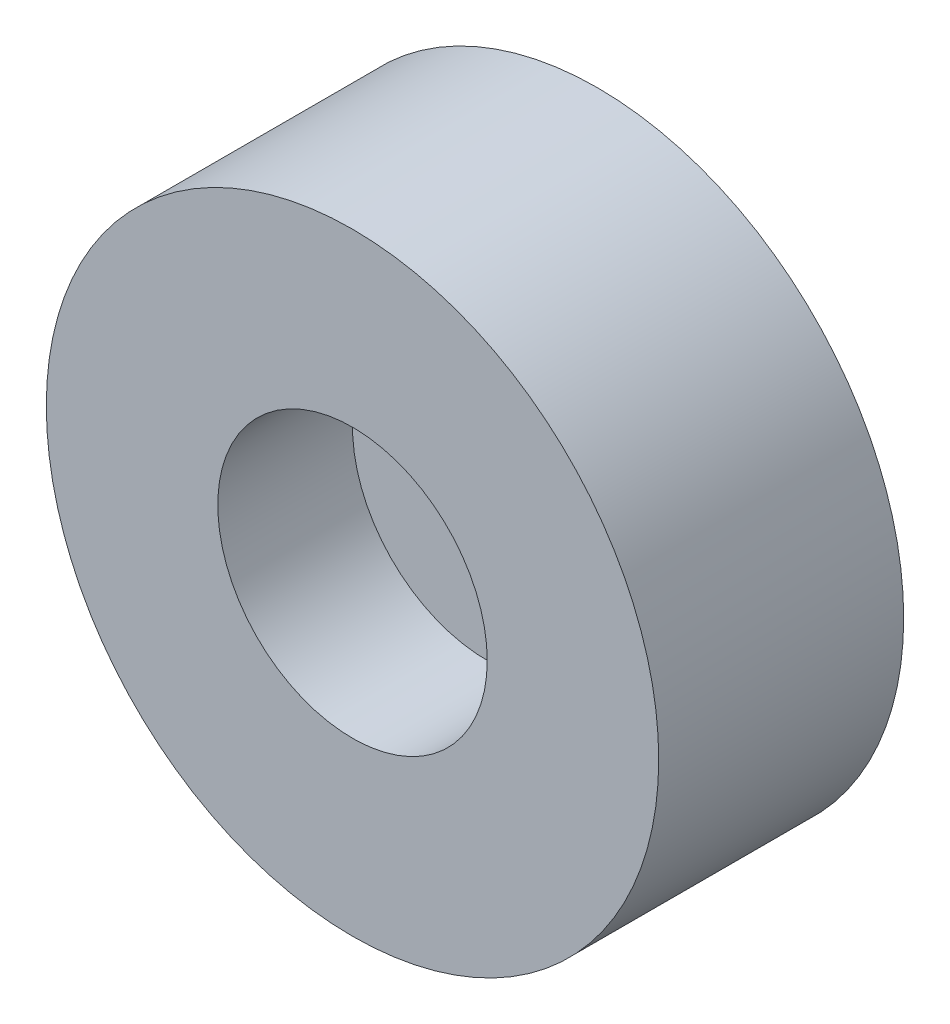
ISO-10303-21;
HEADER;
FILE_DESCRIPTION(('STEP AP214'),'2;1');
FILE_NAME('part.step','',(''),(''),'','','');
FILE_SCHEMA(('AUTOMOTIVE_DESIGN { 1 0 10303 214 1 1 1 1 }'));
ENDSEC;
DATA;
#1=APPLICATION_CONTEXT('core data for automotive mechanical design processes');
#2=APPLICATION_PROTOCOL_DEFINITION('international standard','automotive_design',2000,#1);
#3=PRODUCT_CONTEXT('',#1,'mechanical');
#4=PRODUCT('Part','Part','',(#3));
#5=PRODUCT_RELATED_PRODUCT_CATEGORY('part','',(#4));
#6=PRODUCT_DEFINITION_FORMATION('','',#4);
#7=PRODUCT_DEFINITION_CONTEXT('part definition',#1,'design');
#8=PRODUCT_DEFINITION('design','',#6,#7);
#9=PRODUCT_DEFINITION_SHAPE('','',#8);
#10=(LENGTH_UNIT() NAMED_UNIT(*) SI_UNIT(.MILLI.,.METRE.));
#11=(NAMED_UNIT(*) PLANE_ANGLE_UNIT() SI_UNIT($,.RADIAN.));
#12=(NAMED_UNIT(*) SI_UNIT($,.STERADIAN.) SOLID_ANGLE_UNIT());
#13=UNCERTAINTY_MEASURE_WITH_UNIT(LENGTH_MEASURE(1.E-05),#10,'distance_accuracy_value','');
#14=(GEOMETRIC_REPRESENTATION_CONTEXT(3) GLOBAL_UNCERTAINTY_ASSIGNED_CONTEXT((#13)) GLOBAL_UNIT_ASSIGNED_CONTEXT((#10,
#11,#12)) REPRESENTATION_CONTEXT('',''));
#15=CARTESIAN_POINT('',(0.,0.,0.));
#16=DIRECTION('',(0.,0.,1.));
#17=DIRECTION('',(1.,0.,0.));
#18=AXIS2_PLACEMENT_3D('',#15,#16,#17);
#19=CARTESIAN_POINT('',(0.,0.,5.08));
#20=DIRECTION('',(0.,0.,-1.));
#21=DIRECTION('',(-1.,0.,0.));
#22=AXIS2_PLACEMENT_3D('',#19,#20,#21);
#23=CYLINDRICAL_SURFACE('',#22,6.35);
#24=CARTESIAN_POINT('',(0.,0.,5.08));
#25=DIRECTION('',(0.,0.,1.));
#26=DIRECTION('',(1.,0.,0.));
#27=AXIS2_PLACEMENT_3D('',#24,#25,#26);
#28=CIRCLE('',#27,6.35);
#29=CARTESIAN_POINT('',(6.35,0.,5.08));
#30=VERTEX_POINT('',#29);
#31=EDGE_CURVE('E10',#30,#30,#28,.T.);
#32=ORIENTED_EDGE('',*,*,#31,.F.);
#33=EDGE_LOOP('',(#32));
#34=FACE_BOUND('',#33,.T.);
#35=CARTESIAN_POINT('',(0.,0.,0.));
#36=DIRECTION('',(0.,0.,1.));
#37=DIRECTION('',(1.,0.,0.));
#38=AXIS2_PLACEMENT_3D('',#35,#36,#37);
#39=CIRCLE('',#38,6.35);
#40=CARTESIAN_POINT('',(6.35,0.,0.));
#41=VERTEX_POINT('',#40);
#42=EDGE_CURVE('E36',#41,#41,#39,.T.);
#43=ORIENTED_EDGE('',*,*,#42,.T.);
#44=EDGE_LOOP('',(#43));
#45=FACE_BOUND('',#44,.T.);
#46=ADVANCED_FACE('F33',(#34,#45),#23,.T.);
#47=CARTESIAN_POINT('',(0.,0.,5.08));
#48=DIRECTION('',(0.,0.,1.));
#49=DIRECTION('',(1.,0.,0.));
#50=AXIS2_PLACEMENT_3D('',#47,#48,#49);
#51=PLANE('',#50);
#52=CARTESIAN_POINT('',(0.,0.,5.08));
#53=DIRECTION('',(0.,0.,1.));
#54=DIRECTION('',(1.,0.,0.));
#55=AXIS2_PLACEMENT_3D('',#52,#53,#54);
#56=CIRCLE('',#55,2.794);
#57=CARTESIAN_POINT('',(2.794,0.,5.08));
#58=VERTEX_POINT('',#57);
#59=EDGE_CURVE('E45',#58,#58,#56,.T.);
#60=ORIENTED_EDGE('',*,*,#59,.F.);
#61=EDGE_LOOP('',(#60));
#62=FACE_BOUND('',#61,.T.);
#63=ORIENTED_EDGE('',*,*,#31,.T.);
#64=EDGE_LOOP('',(#63));
#65=FACE_BOUND('',#64,.T.);
#66=ADVANCED_FACE('F60',(#62,#65),#51,.T.);
#67=CARTESIAN_POINT('',(0.,0.,0.));
#68=DIRECTION('',(0.,0.,1.));
#69=DIRECTION('',(1.,0.,0.));
#70=AXIS2_PLACEMENT_3D('',#67,#68,#69);
#71=PLANE('',#70);
#72=ORIENTED_EDGE('',*,*,#42,.F.);
#73=EDGE_LOOP('',(#72));
#74=FACE_BOUND('',#73,.T.);
#75=ADVANCED_FACE('F56',(#74),#71,.F.);
#76=CARTESIAN_POINT('',(0.,0.,2.286));
#77=DIRECTION('',(0.,0.,1.));
#78=DIRECTION('',(1.,0.,0.));
#79=AXIS2_PLACEMENT_3D('',#76,#77,#78);
#80=CYLINDRICAL_SURFACE('',#79,2.794);
#81=CARTESIAN_POINT('',(0.,0.,2.286));
#82=DIRECTION('',(0.,0.,1.));
#83=DIRECTION('',(1.,0.,0.));
#84=AXIS2_PLACEMENT_3D('',#81,#82,#83);
#85=CIRCLE('',#84,2.794);
#86=CARTESIAN_POINT('',(2.794,0.,2.286));
#87=VERTEX_POINT('',#86);
#88=EDGE_CURVE('E43',#87,#87,#85,.T.);
#89=ORIENTED_EDGE('',*,*,#88,.F.);
#90=EDGE_LOOP('',(#89));
#91=FACE_BOUND('',#90,.T.);
#92=ORIENTED_EDGE('',*,*,#59,.T.);
#93=EDGE_LOOP('',(#92));
#94=FACE_BOUND('',#93,.T.);
#95=ADVANCED_FACE('F53',(#91,#94),#80,.F.);
#96=CARTESIAN_POINT('',(0.,0.,2.286));
#97=DIRECTION('',(0.,0.,1.));
#98=DIRECTION('',(1.,0.,0.));
#99=AXIS2_PLACEMENT_3D('',#96,#97,#98);
#100=PLANE('',#99);
#101=ORIENTED_EDGE('',*,*,#88,.T.);
#102=EDGE_LOOP('',(#101));
#103=FACE_BOUND('',#102,.T.);
#104=ADVANCED_FACE('F51',(#103),#100,.T.);
#105=CLOSED_SHELL('',(#46,#66,#75,#95,#104));
#106=MANIFOLD_SOLID_BREP('B2',#105);
#107=ADVANCED_BREP_SHAPE_REPRESENTATION('',(#18,#106),#14);
#108=SHAPE_DEFINITION_REPRESENTATION(#9,#107);
ENDSEC;
END-ISO-10303-21;
